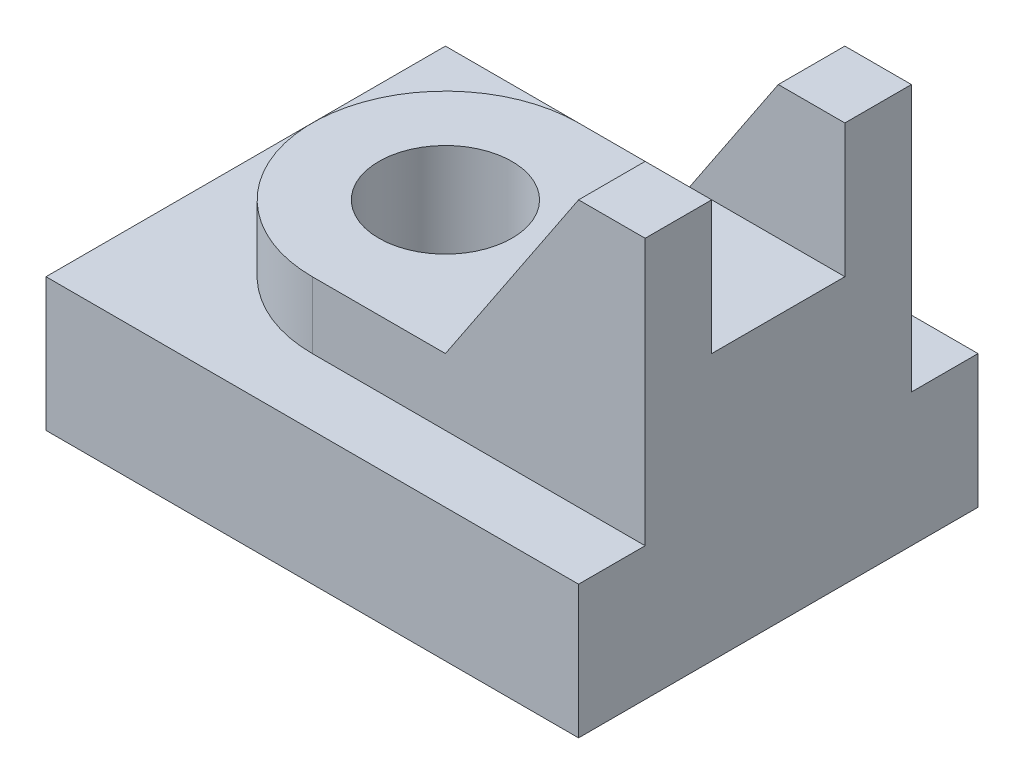
ISO-10303-21;
HEADER;
FILE_DESCRIPTION(('STEP AP214'),'2;1');
FILE_NAME('part.step','',(''),(''),'','','');
FILE_SCHEMA(('AUTOMOTIVE_DESIGN { 1 0 10303 214 1 1 1 1 }'));
ENDSEC;
DATA;
#1=APPLICATION_CONTEXT('core data for automotive mechanical design processes');
#2=APPLICATION_PROTOCOL_DEFINITION('international standard','automotive_design',2000,#1);
#3=PRODUCT_CONTEXT('',#1,'mechanical');
#4=PRODUCT('Part','Part','',(#3));
#5=PRODUCT_RELATED_PRODUCT_CATEGORY('part','',(#4));
#6=PRODUCT_DEFINITION_FORMATION('','',#4);
#7=PRODUCT_DEFINITION_CONTEXT('part definition',#1,'design');
#8=PRODUCT_DEFINITION('design','',#6,#7);
#9=PRODUCT_DEFINITION_SHAPE('','',#8);
#10=(LENGTH_UNIT() NAMED_UNIT(*) SI_UNIT(.MILLI.,.METRE.));
#11=(NAMED_UNIT(*) PLANE_ANGLE_UNIT() SI_UNIT($,.RADIAN.));
#12=(NAMED_UNIT(*) SI_UNIT($,.STERADIAN.) SOLID_ANGLE_UNIT());
#13=UNCERTAINTY_MEASURE_WITH_UNIT(LENGTH_MEASURE(1.E-05),#10,'distance_accuracy_value','');
#14=(GEOMETRIC_REPRESENTATION_CONTEXT(3) GLOBAL_UNCERTAINTY_ASSIGNED_CONTEXT((#13)) GLOBAL_UNIT_ASSIGNED_CONTEXT((#10,
#11,#12)) REPRESENTATION_CONTEXT('',''));
#15=CARTESIAN_POINT('',(0.,0.,0.));
#16=DIRECTION('',(0.,0.,1.));
#17=DIRECTION('',(1.,0.,0.));
#18=AXIS2_PLACEMENT_3D('',#15,#16,#17);
#19=CARTESIAN_POINT('',(15.,30.,-31.2132034355964));
#20=DIRECTION('',(0.,1.,0.));
#21=DIRECTION('',(0.,0.,1.));
#22=AXIS2_PLACEMENT_3D('',#19,#20,#21);
#23=PLANE('',#22);
#24=DIRECTION('',(-1.,0.,0.));
#25=VECTOR('',#24,1.);
#26=CARTESIAN_POINT('',(15.,30.,-5.));
#27=LINE('',#26,#25);
#28=CARTESIAN_POINT('',(20.,30.,-5.));
#29=VERTEX_POINT('',#28);
#30=CARTESIAN_POINT('',(15.,30.,-5.));
#31=VERTEX_POINT('',#30);
#32=EDGE_CURVE('E48',#29,#31,#27,.T.);
#33=ORIENTED_EDGE('',*,*,#32,.F.);
#34=DIRECTION('',(0.,0.,1.));
#35=VECTOR('',#34,1.);
#36=CARTESIAN_POINT('',(20.,30.,-31.2132034355964));
#37=LINE('',#36,#35);
#38=CARTESIAN_POINT('',(20.,30.,-10.));
#39=VERTEX_POINT('',#38);
#40=EDGE_CURVE('E166',#39,#29,#37,.T.);
#41=ORIENTED_EDGE('',*,*,#40,.F.);
#42=DIRECTION('',(1.,0.,0.));
#43=VECTOR('',#42,1.);
#44=CARTESIAN_POINT('',(15.,30.,-10.));
#45=LINE('',#44,#43);
#46=CARTESIAN_POINT('',(15.,30.,-10.));
#47=VERTEX_POINT('',#46);
#48=EDGE_CURVE('E178',#47,#39,#45,.T.);
#49=ORIENTED_EDGE('',*,*,#48,.F.);
#50=DIRECTION('',(0.,0.,1.));
#51=VECTOR('',#50,1.);
#52=CARTESIAN_POINT('',(15.,30.,-31.2132034355964));
#53=LINE('',#52,#51);
#54=EDGE_CURVE('E176',#47,#31,#53,.T.);
#55=ORIENTED_EDGE('',*,*,#54,.T.);
#56=EDGE_LOOP('',(#33,#41,#49,#55));
#57=FACE_BOUND('',#56,.T.);
#58=ADVANCED_FACE('F39',(#57),#23,.T.);
#59=CARTESIAN_POINT('',(20.,10.,15.));
#60=DIRECTION('',(-1.,0.,0.));
#61=DIRECTION('',(0.,0.,1.));
#62=AXIS2_PLACEMENT_3D('',#59,#60,#61);
#63=PLANE('',#62);
#64=ORIENTED_EDGE('',*,*,#40,.T.);
#65=DIRECTION('',(0.,1.,0.));
#66=VECTOR('',#65,1.);
#67=CARTESIAN_POINT('',(20.,20.,-5.));
#68=LINE('',#67,#66);
#69=CARTESIAN_POINT('',(20.,20.,-5.));
#70=VERTEX_POINT('',#69);
#71=EDGE_CURVE('E266',#70,#29,#68,.T.);
#72=ORIENTED_EDGE('',*,*,#71,.F.);
#73=DIRECTION('',(0.,0.,-1.));
#74=VECTOR('',#73,1.);
#75=CARTESIAN_POINT('',(20.,20.,5.));
#76=LINE('',#75,#74);
#77=CARTESIAN_POINT('',(20.,20.,5.));
#78=VERTEX_POINT('',#77);
#79=EDGE_CURVE('E157',#78,#70,#76,.T.);
#80=ORIENTED_EDGE('',*,*,#79,.F.);
#81=DIRECTION('',(0.,-1.,0.));
#82=VECTOR('',#81,1.);
#83=CARTESIAN_POINT('',(20.,30.,5.));
#84=LINE('',#83,#82);
#85=CARTESIAN_POINT('',(20.,30.,5.));
#86=VERTEX_POINT('',#85);
#87=EDGE_CURVE('E142',#86,#78,#84,.T.);
#88=ORIENTED_EDGE('',*,*,#87,.F.);
#89=CARTESIAN_POINT('',(20.,30.,10.));
#90=VERTEX_POINT('',#89);
#91=EDGE_CURVE('E153',#86,#90,#37,.T.);
#92=ORIENTED_EDGE('',*,*,#91,.T.);
#93=DIRECTION('',(0.,-1.,0.));
#94=VECTOR('',#93,1.);
#95=CARTESIAN_POINT('',(20.,15.,10.));
#96=LINE('',#95,#94);
#97=CARTESIAN_POINT('',(20.,10.,10.));
#98=VERTEX_POINT('',#97);
#99=EDGE_CURVE('E208',#90,#98,#96,.T.);
#100=ORIENTED_EDGE('',*,*,#99,.T.);
#101=DIRECTION('',(0.,0.,-1.));
#102=VECTOR('',#101,1.);
#103=CARTESIAN_POINT('',(20.,10.,15.));
#104=LINE('',#103,#102);
#105=CARTESIAN_POINT('',(20.,10.,15.));
#106=VERTEX_POINT('',#105);
#107=EDGE_CURVE('E220',#106,#98,#104,.T.);
#108=ORIENTED_EDGE('',*,*,#107,.F.);
#109=DIRECTION('',(0.,-1.,0.));
#110=VECTOR('',#109,1.);
#111=CARTESIAN_POINT('',(20.,10.,15.));
#112=LINE('',#111,#110);
#113=CARTESIAN_POINT('',(20.,0.,15.));
#114=VERTEX_POINT('',#113);
#115=EDGE_CURVE('E233',#106,#114,#112,.T.);
#116=ORIENTED_EDGE('',*,*,#115,.T.);
#117=DIRECTION('',(0.,0.,-1.));
#118=VECTOR('',#117,1.);
#119=CARTESIAN_POINT('',(20.,0.,15.));
#120=LINE('',#119,#118);
#121=CARTESIAN_POINT('',(20.,0.,-15.));
#122=VERTEX_POINT('',#121);
#123=EDGE_CURVE('E219',#114,#122,#120,.T.);
#124=ORIENTED_EDGE('',*,*,#123,.T.);
#125=DIRECTION('',(0.,-1.,0.));
#126=VECTOR('',#125,1.);
#127=CARTESIAN_POINT('',(20.,10.,-15.));
#128=LINE('',#127,#126);
#129=CARTESIAN_POINT('',(20.,10.,-15.));
#130=VERTEX_POINT('',#129);
#131=EDGE_CURVE('E148',#130,#122,#128,.T.);
#132=ORIENTED_EDGE('',*,*,#131,.F.);
#133=CARTESIAN_POINT('',(20.,10.,-10.));
#134=VERTEX_POINT('',#133);
#135=EDGE_CURVE('E224',#134,#130,#104,.T.);
#136=ORIENTED_EDGE('',*,*,#135,.F.);
#137=DIRECTION('',(0.,-1.,0.));
#138=VECTOR('',#137,1.);
#139=CARTESIAN_POINT('',(20.,15.,-10.));
#140=LINE('',#139,#138);
#141=EDGE_CURVE('E194',#39,#134,#140,.T.);
#142=ORIENTED_EDGE('',*,*,#141,.F.);
#143=EDGE_LOOP('',(#64,#72,#80,#88,#92,#100,#108,#116,#124,#132,#136,#142));
#144=FACE_BOUND('',#143,.T.);
#145=ADVANCED_FACE('F41',(#144),#63,.F.);
#146=CARTESIAN_POINT('',(-20.,10.,-15.));
#147=DIRECTION('',(0.,0.,1.));
#148=DIRECTION('',(1.,0.,0.));
#149=AXIS2_PLACEMENT_3D('',#146,#147,#148);
#150=PLANE('',#149);
#151=DIRECTION('',(-1.,0.,0.));
#152=VECTOR('',#151,1.);
#153=CARTESIAN_POINT('',(-20.,0.,-15.));
#154=LINE('',#153,#152);
#155=CARTESIAN_POINT('',(-20.,0.,-15.));
#156=VERTEX_POINT('',#155);
#157=EDGE_CURVE('E237',#122,#156,#154,.T.);
#158=ORIENTED_EDGE('',*,*,#157,.T.);
#159=DIRECTION('',(0.,-1.,0.));
#160=VECTOR('',#159,1.);
#161=CARTESIAN_POINT('',(-20.,10.,-15.));
#162=LINE('',#161,#160);
#163=CARTESIAN_POINT('',(-20.,10.,-15.));
#164=VERTEX_POINT('',#163);
#165=EDGE_CURVE('E253',#164,#156,#162,.T.);
#166=ORIENTED_EDGE('',*,*,#165,.F.);
#167=DIRECTION('',(-1.,0.,0.));
#168=VECTOR('',#167,1.);
#169=CARTESIAN_POINT('',(-20.,10.,-15.));
#170=LINE('',#169,#168);
#171=EDGE_CURVE('E223',#130,#164,#170,.T.);
#172=ORIENTED_EDGE('',*,*,#171,.F.);
#173=ORIENTED_EDGE('',*,*,#131,.T.);
#174=EDGE_LOOP('',(#158,#166,#172,#173));
#175=FACE_BOUND('',#174,.T.);
#176=ADVANCED_FACE('F334',(#175),#150,.F.);
#177=CARTESIAN_POINT('',(-20.,10.,15.));
#178=DIRECTION('',(1.,0.,0.));
#179=DIRECTION('',(0.,0.,-1.));
#180=AXIS2_PLACEMENT_3D('',#177,#178,#179);
#181=PLANE('',#180);
#182=DIRECTION('',(0.,0.,1.));
#183=VECTOR('',#182,1.);
#184=CARTESIAN_POINT('',(-20.,0.,15.));
#185=LINE('',#184,#183);
#186=CARTESIAN_POINT('',(-20.,0.,15.));
#187=VERTEX_POINT('',#186);
#188=EDGE_CURVE('E240',#156,#187,#185,.T.);
#189=ORIENTED_EDGE('',*,*,#188,.T.);
#190=DIRECTION('',(0.,-1.,0.));
#191=VECTOR('',#190,1.);
#192=CARTESIAN_POINT('',(-20.,10.,15.));
#193=LINE('',#192,#191);
#194=CARTESIAN_POINT('',(-20.,10.,15.));
#195=VERTEX_POINT('',#194);
#196=EDGE_CURVE('E249',#195,#187,#193,.T.);
#197=ORIENTED_EDGE('',*,*,#196,.F.);
#198=DIRECTION('',(0.,0.,1.));
#199=VECTOR('',#198,1.);
#200=CARTESIAN_POINT('',(-20.,10.,15.));
#201=LINE('',#200,#199);
#202=EDGE_CURVE('E227',#164,#195,#201,.T.);
#203=ORIENTED_EDGE('',*,*,#202,.F.);
#204=ORIENTED_EDGE('',*,*,#165,.T.);
#205=EDGE_LOOP('',(#189,#197,#203,#204));
#206=FACE_BOUND('',#205,.T.);
#207=ADVANCED_FACE('F435',(#206),#181,.F.);
#208=CARTESIAN_POINT('',(-20.,10.,15.));
#209=DIRECTION('',(0.,0.,-1.));
#210=DIRECTION('',(-1.,0.,0.));
#211=AXIS2_PLACEMENT_3D('',#208,#209,#210);
#212=PLANE('',#211);
#213=DIRECTION('',(1.,0.,0.));
#214=VECTOR('',#213,1.);
#215=CARTESIAN_POINT('',(-20.,0.,15.));
#216=LINE('',#215,#214);
#217=EDGE_CURVE('E243',#187,#114,#216,.T.);
#218=ORIENTED_EDGE('',*,*,#217,.T.);
#219=ORIENTED_EDGE('',*,*,#115,.F.);
#220=DIRECTION('',(1.,0.,0.));
#221=VECTOR('',#220,1.);
#222=CARTESIAN_POINT('',(-20.,10.,15.));
#223=LINE('',#222,#221);
#224=EDGE_CURVE('E230',#195,#106,#223,.T.);
#225=ORIENTED_EDGE('',*,*,#224,.F.);
#226=ORIENTED_EDGE('',*,*,#196,.T.);
#227=EDGE_LOOP('',(#218,#219,#225,#226));
#228=FACE_BOUND('',#227,.T.);
#229=ADVANCED_FACE('F441',(#228),#212,.F.);
#230=CARTESIAN_POINT('',(0.,10.,0.));
#231=DIRECTION('',(0.,-1.,0.));
#232=DIRECTION('',(0.,0.,-1.));
#233=AXIS2_PLACEMENT_3D('',#230,#231,#232);
#234=PLANE('',#233);
#235=DIRECTION('',(-1.,0.,0.));
#236=VECTOR('',#235,1.);
#237=CARTESIAN_POINT('',(20.,10.,-10.));
#238=LINE('',#237,#236);
#239=CARTESIAN_POINT('',(-5.,10.,-10.));
#240=VERTEX_POINT('',#239);
#241=EDGE_CURVE('E182',#134,#240,#238,.T.);
#242=ORIENTED_EDGE('',*,*,#241,.F.);
#243=ORIENTED_EDGE('',*,*,#135,.T.);
#244=ORIENTED_EDGE('',*,*,#171,.T.);
#245=ORIENTED_EDGE('',*,*,#202,.T.);
#246=ORIENTED_EDGE('',*,*,#224,.T.);
#247=ORIENTED_EDGE('',*,*,#107,.T.);
#248=DIRECTION('',(1.,0.,0.));
#249=VECTOR('',#248,1.);
#250=CARTESIAN_POINT('',(20.,10.,10.));
#251=LINE('',#250,#249);
#252=CARTESIAN_POINT('',(-5.,10.,10.));
#253=VERTEX_POINT('',#252);
#254=EDGE_CURVE('E188',#253,#98,#251,.T.);
#255=ORIENTED_EDGE('',*,*,#254,.F.);
#256=CARTESIAN_POINT('',(-5.,10.,0.));
#257=DIRECTION('',(0.,1.,0.));
#258=DIRECTION('',(0.,0.,1.));
#259=AXIS2_PLACEMENT_3D('',#256,#257,#258);
#260=CIRCLE('',#259,10.);
#261=EDGE_CURVE('E198',#240,#253,#260,.T.);
#262=ORIENTED_EDGE('',*,*,#261,.F.);
#263=EDGE_LOOP('',(#242,#243,#244,#245,#246,#247,#255,#262));
#264=FACE_BOUND('',#263,.T.);
#265=ADVANCED_FACE('F371',(#264),#234,.F.);
#266=CARTESIAN_POINT('',(0.,0.,0.));
#267=DIRECTION('',(0.,-1.,0.));
#268=DIRECTION('',(0.,0.,-1.));
#269=AXIS2_PLACEMENT_3D('',#266,#267,#268);
#270=PLANE('',#269);
#271=CARTESIAN_POINT('',(-5.,0.,0.));
#272=DIRECTION('',(0.,1.,0.));
#273=DIRECTION('',(0.,0.,1.));
#274=AXIS2_PLACEMENT_3D('',#271,#272,#273);
#275=CIRCLE('',#274,5.);
#276=CARTESIAN_POINT('',(-5.,0.,5.));
#277=VERTEX_POINT('',#276);
#278=EDGE_CURVE('E159',#277,#277,#275,.T.);
#279=ORIENTED_EDGE('',*,*,#278,.T.);
#280=EDGE_LOOP('',(#279));
#281=FACE_BOUND('',#280,.T.);
#282=ORIENTED_EDGE('',*,*,#123,.F.);
#283=ORIENTED_EDGE('',*,*,#217,.F.);
#284=ORIENTED_EDGE('',*,*,#188,.F.);
#285=ORIENTED_EDGE('',*,*,#157,.F.);
#286=EDGE_LOOP('',(#282,#283,#284,#285));
#287=FACE_BOUND('',#286,.T.);
#288=ADVANCED_FACE('F310',(#281,#287),#270,.T.);
#289=CARTESIAN_POINT('',(20.,15.,-10.));
#290=DIRECTION('',(0.,0.,1.));
#291=DIRECTION('',(1.,0.,0.));
#292=AXIS2_PLACEMENT_3D('',#289,#290,#291);
#293=PLANE('',#292);
#294=ORIENTED_EDGE('',*,*,#241,.T.);
#295=DIRECTION('',(0.,-1.,0.));
#296=VECTOR('',#295,1.);
#297=CARTESIAN_POINT('',(-5.,15.,-10.));
#298=LINE('',#297,#296);
#299=CARTESIAN_POINT('',(-5.,15.,-10.));
#300=VERTEX_POINT('',#299);
#301=EDGE_CURVE('E215',#300,#240,#298,.T.);
#302=ORIENTED_EDGE('',*,*,#301,.F.);
#303=DIRECTION('',(-1.,0.,0.));
#304=VECTOR('',#303,1.);
#305=CARTESIAN_POINT('',(20.,15.,-10.));
#306=LINE('',#305,#304);
#307=CARTESIAN_POINT('',(5.,15.,-10.));
#308=VERTEX_POINT('',#307);
#309=EDGE_CURVE('E184',#308,#300,#306,.T.);
#310=ORIENTED_EDGE('',*,*,#309,.F.);
#311=DIRECTION('',(0.554700196225229,0.832050294337844,0.));
#312=VECTOR('',#311,1.);
#313=CARTESIAN_POINT('',(5.,15.,-10.));
#314=LINE('',#313,#312);
#315=EDGE_CURVE('E183',#308,#47,#314,.T.);
#316=ORIENTED_EDGE('',*,*,#315,.T.);
#317=ORIENTED_EDGE('',*,*,#48,.T.);
#318=ORIENTED_EDGE('',*,*,#141,.T.);
#319=EDGE_LOOP('',(#294,#302,#310,#316,#317,#318));
#320=FACE_BOUND('',#319,.T.);
#321=ADVANCED_FACE('F370',(#320),#293,.F.);
#322=CARTESIAN_POINT('',(-5.,15.,0.));
#323=DIRECTION('',(0.,-1.,0.));
#324=DIRECTION('',(0.,0.,-1.));
#325=AXIS2_PLACEMENT_3D('',#322,#323,#324);
#326=CYLINDRICAL_SURFACE('',#325,10.);
#327=ORIENTED_EDGE('',*,*,#261,.T.);
#328=DIRECTION('',(0.,-1.,0.));
#329=VECTOR('',#328,1.);
#330=CARTESIAN_POINT('',(-5.,15.,10.));
#331=LINE('',#330,#329);
#332=CARTESIAN_POINT('',(-5.,15.,10.));
#333=VERTEX_POINT('',#332);
#334=EDGE_CURVE('E211',#333,#253,#331,.T.);
#335=ORIENTED_EDGE('',*,*,#334,.F.);
#336=CARTESIAN_POINT('',(-5.,15.,0.));
#337=DIRECTION('',(0.,1.,0.));
#338=DIRECTION('',(0.,0.,1.));
#339=AXIS2_PLACEMENT_3D('',#336,#337,#338);
#340=CIRCLE('',#339,10.);
#341=EDGE_CURVE('E187',#300,#333,#340,.T.);
#342=ORIENTED_EDGE('',*,*,#341,.F.);
#343=ORIENTED_EDGE('',*,*,#301,.T.);
#344=EDGE_LOOP('',(#327,#335,#342,#343));
#345=FACE_BOUND('',#344,.T.);
#346=ADVANCED_FACE('F327',(#345),#326,.T.);
#347=CARTESIAN_POINT('',(20.,15.,10.));
#348=DIRECTION('',(0.,0.,-1.));
#349=DIRECTION('',(-1.,0.,0.));
#350=AXIS2_PLACEMENT_3D('',#347,#348,#349);
#351=PLANE('',#350);
#352=ORIENTED_EDGE('',*,*,#254,.T.);
#353=ORIENTED_EDGE('',*,*,#99,.F.);
#354=DIRECTION('',(-1.,0.,0.));
#355=VECTOR('',#354,1.);
#356=CARTESIAN_POINT('',(15.,30.,10.));
#357=LINE('',#356,#355);
#358=CARTESIAN_POINT('',(15.,30.,10.));
#359=VERTEX_POINT('',#358);
#360=EDGE_CURVE('E164',#90,#359,#357,.T.);
#361=ORIENTED_EDGE('',*,*,#360,.T.);
#362=DIRECTION('',(-0.554700196225229,-0.832050294337844,0.));
#363=VECTOR('',#362,1.);
#364=CARTESIAN_POINT('',(5.,15.,10.));
#365=LINE('',#364,#363);
#366=CARTESIAN_POINT('',(5.,15.,10.));
#367=VERTEX_POINT('',#366);
#368=EDGE_CURVE('E167',#359,#367,#365,.T.);
#369=ORIENTED_EDGE('',*,*,#368,.T.);
#370=DIRECTION('',(1.,0.,0.));
#371=VECTOR('',#370,1.);
#372=CARTESIAN_POINT('',(20.,15.,10.));
#373=LINE('',#372,#371);
#374=EDGE_CURVE('E191',#333,#367,#373,.T.);
#375=ORIENTED_EDGE('',*,*,#374,.F.);
#376=ORIENTED_EDGE('',*,*,#334,.T.);
#377=EDGE_LOOP('',(#352,#353,#361,#369,#375,#376));
#378=FACE_BOUND('',#377,.T.);
#379=ADVANCED_FACE('F284',(#378),#351,.F.);
#380=CARTESIAN_POINT('',(-5.,15.,0.));
#381=DIRECTION('',(0.,1.,0.));
#382=DIRECTION('',(0.,0.,1.));
#383=AXIS2_PLACEMENT_3D('',#380,#381,#382);
#384=PLANE('',#383);
#385=CARTESIAN_POINT('',(-5.,15.,0.));
#386=DIRECTION('',(0.,1.,0.));
#387=DIRECTION('',(0.,0.,1.));
#388=AXIS2_PLACEMENT_3D('',#385,#386,#387);
#389=CIRCLE('',#388,5.);
#390=CARTESIAN_POINT('',(-5.,15.,5.));
#391=VERTEX_POINT('',#390);
#392=EDGE_CURVE('E302',#391,#391,#389,.T.);
#393=ORIENTED_EDGE('',*,*,#392,.F.);
#394=EDGE_LOOP('',(#393));
#395=FACE_BOUND('',#394,.T.);
#396=DIRECTION('',(0.,0.,1.));
#397=VECTOR('',#396,1.);
#398=CARTESIAN_POINT('',(5.,15.,-31.2132034355964));
#399=LINE('',#398,#397);
#400=EDGE_CURVE('E63',#308,#367,#399,.T.);
#401=ORIENTED_EDGE('',*,*,#400,.F.);
#402=ORIENTED_EDGE('',*,*,#309,.T.);
#403=ORIENTED_EDGE('',*,*,#341,.T.);
#404=ORIENTED_EDGE('',*,*,#374,.T.);
#405=EDGE_LOOP('',(#401,#402,#403,#404));
#406=FACE_BOUND('',#405,.T.);
#407=ADVANCED_FACE('F319',(#395,#406),#384,.T.);
#408=CARTESIAN_POINT('',(5.,15.,-31.2132034355964));
#409=DIRECTION('',(-0.832050294337844,0.554700196225229,0.));
#410=DIRECTION('',(-0.554700196225229,-0.832050294337844,0.));
#411=AXIS2_PLACEMENT_3D('',#408,#409,#410);
#412=PLANE('',#411);
#413=DIRECTION('',(-0.554700196225229,-0.832050294337844,0.));
#414=VECTOR('',#413,1.);
#415=CARTESIAN_POINT('',(5.,15.,-5.));
#416=LINE('',#415,#414);
#417=CARTESIAN_POINT('',(8.33333333333334,20.,-5.));
#418=VERTEX_POINT('',#417);
#419=EDGE_CURVE('E264',#31,#418,#416,.T.);
#420=ORIENTED_EDGE('',*,*,#419,.F.);
#421=ORIENTED_EDGE('',*,*,#54,.F.);
#422=ORIENTED_EDGE('',*,*,#315,.F.);
#423=ORIENTED_EDGE('',*,*,#400,.T.);
#424=ORIENTED_EDGE('',*,*,#368,.F.);
#425=CARTESIAN_POINT('',(15.,30.,5.));
#426=VERTEX_POINT('',#425);
#427=EDGE_CURVE('E171',#426,#359,#53,.T.);
#428=ORIENTED_EDGE('',*,*,#427,.F.);
#429=DIRECTION('',(0.554700196225229,0.832050294337844,0.));
#430=VECTOR('',#429,1.);
#431=CARTESIAN_POINT('',(5.,15.,5.));
#432=LINE('',#431,#430);
#433=CARTESIAN_POINT('',(8.33333333333333,20.,5.));
#434=VERTEX_POINT('',#433);
#435=EDGE_CURVE('E55',#434,#426,#432,.T.);
#436=ORIENTED_EDGE('',*,*,#435,.F.);
#437=DIRECTION('',(0.,0.,1.));
#438=VECTOR('',#437,1.);
#439=CARTESIAN_POINT('',(8.33333333333334,20.,-31.2132034355964));
#440=LINE('',#439,#438);
#441=EDGE_CURVE('E11',#418,#434,#440,.T.);
#442=ORIENTED_EDGE('',*,*,#441,.F.);
#443=EDGE_LOOP('',(#420,#421,#422,#423,#424,#428,#436,#442));
#444=FACE_BOUND('',#443,.T.);
#445=ADVANCED_FACE('F273',(#444),#412,.T.);
#446=DIRECTION('',(1.,0.,0.));
#447=VECTOR('',#446,1.);
#448=CARTESIAN_POINT('',(15.,30.,5.));
#449=LINE('',#448,#447);
#450=EDGE_CURVE('E139',#426,#86,#449,.T.);
#451=ORIENTED_EDGE('',*,*,#450,.F.);
#452=ORIENTED_EDGE('',*,*,#427,.T.);
#453=ORIENTED_EDGE('',*,*,#360,.F.);
#454=ORIENTED_EDGE('',*,*,#91,.F.);
#455=EDGE_LOOP('',(#451,#452,#453,#454));
#456=FACE_BOUND('',#455,.T.);
#457=ADVANCED_FACE('F162',(#456),#23,.T.);
#458=CARTESIAN_POINT('',(-20.,20.,-5.));
#459=DIRECTION('',(0.,0.,-1.));
#460=DIRECTION('',(0.,1.,0.));
#461=AXIS2_PLACEMENT_3D('',#458,#459,#460);
#462=PLANE('',#461);
#463=ORIENTED_EDGE('',*,*,#419,.T.);
#464=DIRECTION('',(1.,0.,0.));
#465=VECTOR('',#464,1.);
#466=CARTESIAN_POINT('',(-20.,20.,-5.));
#467=LINE('',#466,#465);
#468=EDGE_CURVE('E292',#418,#70,#467,.T.);
#469=ORIENTED_EDGE('',*,*,#468,.T.);
#470=ORIENTED_EDGE('',*,*,#71,.T.);
#471=ORIENTED_EDGE('',*,*,#32,.T.);
#472=EDGE_LOOP('',(#463,#469,#470,#471));
#473=FACE_BOUND('',#472,.T.);
#474=ADVANCED_FACE('F263',(#473),#462,.F.);
#475=CARTESIAN_POINT('',(-20.,20.,5.));
#476=DIRECTION('',(0.,-1.,0.));
#477=DIRECTION('',(0.,0.,-1.));
#478=AXIS2_PLACEMENT_3D('',#475,#476,#477);
#479=PLANE('',#478);
#480=ORIENTED_EDGE('',*,*,#441,.T.);
#481=DIRECTION('',(1.,0.,0.));
#482=VECTOR('',#481,1.);
#483=CARTESIAN_POINT('',(-20.,20.,5.));
#484=LINE('',#483,#482);
#485=EDGE_CURVE('E293',#434,#78,#484,.T.);
#486=ORIENTED_EDGE('',*,*,#485,.T.);
#487=ORIENTED_EDGE('',*,*,#79,.T.);
#488=ORIENTED_EDGE('',*,*,#468,.F.);
#489=EDGE_LOOP('',(#480,#486,#487,#488));
#490=FACE_BOUND('',#489,.T.);
#491=ADVANCED_FACE('F339',(#490),#479,.F.);
#492=CARTESIAN_POINT('',(-20.,30.,5.));
#493=DIRECTION('',(0.,0.,1.));
#494=DIRECTION('',(0.,-1.,0.));
#495=AXIS2_PLACEMENT_3D('',#492,#493,#494);
#496=PLANE('',#495);
#497=ORIENTED_EDGE('',*,*,#435,.T.);
#498=ORIENTED_EDGE('',*,*,#450,.T.);
#499=ORIENTED_EDGE('',*,*,#87,.T.);
#500=ORIENTED_EDGE('',*,*,#485,.F.);
#501=EDGE_LOOP('',(#497,#498,#499,#500));
#502=FACE_BOUND('',#501,.T.);
#503=ADVANCED_FACE('F141',(#502),#496,.F.);
#504=CARTESIAN_POINT('',(-5.,0.,0.));
#505=DIRECTION('',(0.,1.,0.));
#506=DIRECTION('',(0.,0.,1.));
#507=AXIS2_PLACEMENT_3D('',#504,#505,#506);
#508=CYLINDRICAL_SURFACE('',#507,5.);
#509=ORIENTED_EDGE('',*,*,#278,.F.);
#510=EDGE_LOOP('',(#509));
#511=FACE_BOUND('',#510,.T.);
#512=ORIENTED_EDGE('',*,*,#392,.T.);
#513=EDGE_LOOP('',(#512));
#514=FACE_BOUND('',#513,.T.);
#515=ADVANCED_FACE('F313',(#511,#514),#508,.F.);
#516=CLOSED_SHELL('',(#58,#145,#176,#207,#229,#265,#288,#321,#346,#379,#407,#445,#457,#474,#491,
#503,#515));
#517=MANIFOLD_SOLID_BREP('B2',#516);
#518=ADVANCED_BREP_SHAPE_REPRESENTATION('',(#18,#517),#14);
#519=SHAPE_DEFINITION_REPRESENTATION(#9,#518);
ENDSEC;
END-ISO-10303-21;
